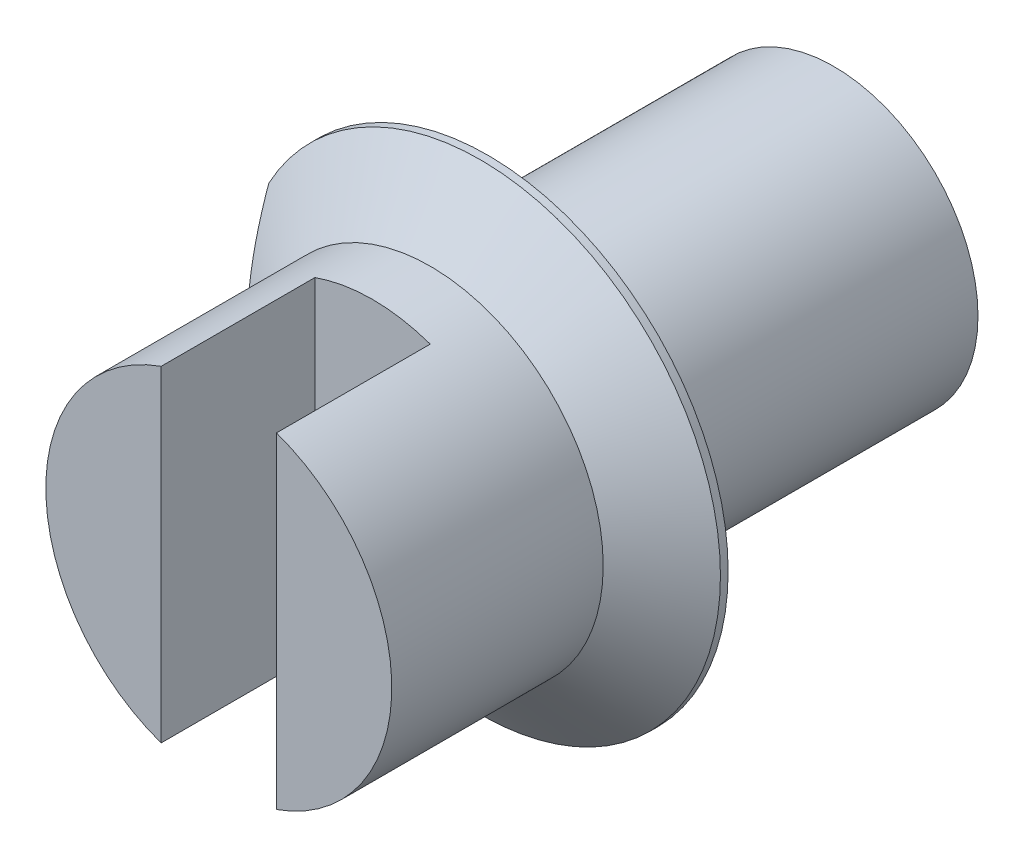
ISO-10303-21;
HEADER;
FILE_DESCRIPTION(('STEP AP214'),'2;1');
FILE_NAME('part.step','',(''),(''),'','','');
FILE_SCHEMA(('AUTOMOTIVE_DESIGN { 1 0 10303 214 1 1 1 1 }'));
ENDSEC;
DATA;
#1=APPLICATION_CONTEXT('core data for automotive mechanical design processes');
#2=APPLICATION_PROTOCOL_DEFINITION('international standard','automotive_design',2000,#1);
#3=PRODUCT_CONTEXT('',#1,'mechanical');
#4=PRODUCT('Part','Part','',(#3));
#5=PRODUCT_RELATED_PRODUCT_CATEGORY('part','',(#4));
#6=PRODUCT_DEFINITION_FORMATION('','',#4);
#7=PRODUCT_DEFINITION_CONTEXT('part definition',#1,'design');
#8=PRODUCT_DEFINITION('design','',#6,#7);
#9=PRODUCT_DEFINITION_SHAPE('','',#8);
#10=(LENGTH_UNIT() NAMED_UNIT(*) SI_UNIT(.MILLI.,.METRE.));
#11=(NAMED_UNIT(*) PLANE_ANGLE_UNIT() SI_UNIT($,.RADIAN.));
#12=(NAMED_UNIT(*) SI_UNIT($,.STERADIAN.) SOLID_ANGLE_UNIT());
#13=UNCERTAINTY_MEASURE_WITH_UNIT(LENGTH_MEASURE(1.E-05),#10,'distance_accuracy_value','');
#14=(GEOMETRIC_REPRESENTATION_CONTEXT(3) GLOBAL_UNCERTAINTY_ASSIGNED_CONTEXT((#13)) GLOBAL_UNIT_ASSIGNED_CONTEXT((#10,
#11,#12)) REPRESENTATION_CONTEXT('',''));
#15=CARTESIAN_POINT('',(0.,0.,0.));
#16=DIRECTION('',(0.,0.,1.));
#17=DIRECTION('',(1.,0.,0.));
#18=AXIS2_PLACEMENT_3D('',#15,#16,#17);
#19=CARTESIAN_POINT('',(0.,0.,0.7));
#20=DIRECTION('',(0.,0.,1.));
#21=DIRECTION('',(1.,0.,0.));
#22=AXIS2_PLACEMENT_3D('',#19,#20,#21);
#23=PLANE('',#22);
#24=DIRECTION('',(0.,-1.,0.));
#25=VECTOR('',#24,1.);
#26=CARTESIAN_POINT('',(-0.15,0.,0.7));
#27=LINE('',#26,#25);
#28=CARTESIAN_POINT('',(-0.15,0.424264068711929,0.7));
#29=VERTEX_POINT('',#28);
#30=CARTESIAN_POINT('',(-0.15,-0.424264068711928,0.7));
#31=VERTEX_POINT('',#30);
#32=EDGE_CURVE('E105',#29,#31,#27,.T.);
#33=ORIENTED_EDGE('',*,*,#32,.F.);
#34=CARTESIAN_POINT('',(0.,0.,0.7));
#35=DIRECTION('',(0.,0.,1.));
#36=DIRECTION('',(1.,0.,0.));
#37=AXIS2_PLACEMENT_3D('',#34,#35,#36);
#38=CIRCLE('',#37,0.45);
#39=EDGE_CURVE('E116',#29,#31,#38,.T.);
#40=ORIENTED_EDGE('',*,*,#39,.T.);
#41=EDGE_LOOP('',(#33,#40));
#42=FACE_BOUND('',#41,.T.);
#43=ADVANCED_FACE('F32',(#42),#23,.T.);
#44=CARTESIAN_POINT('',(0.,0.,-0.9));
#45=DIRECTION('',(0.,0.,1.));
#46=DIRECTION('',(1.,0.,0.));
#47=AXIS2_PLACEMENT_3D('',#44,#45,#46);
#48=CYLINDRICAL_SURFACE('',#47,0.375);
#49=CARTESIAN_POINT('',(0.,0.,-0.9));
#50=DIRECTION('',(0.,0.,1.));
#51=DIRECTION('',(1.,0.,0.));
#52=AXIS2_PLACEMENT_3D('',#49,#50,#51);
#53=CIRCLE('',#52,0.375);
#54=CARTESIAN_POINT('',(0.375,0.,-0.9));
#55=VERTEX_POINT('',#54);
#56=EDGE_CURVE('E109',#55,#55,#53,.T.);
#57=ORIENTED_EDGE('',*,*,#56,.T.);
#58=EDGE_LOOP('',(#57));
#59=FACE_BOUND('',#58,.T.);
#60=CARTESIAN_POINT('',(0.,0.,0.));
#61=DIRECTION('',(0.,0.,1.));
#62=DIRECTION('',(1.,0.,0.));
#63=AXIS2_PLACEMENT_3D('',#60,#61,#62);
#64=CIRCLE('',#63,0.375);
#65=CARTESIAN_POINT('',(0.375,0.,0.));
#66=VERTEX_POINT('',#65);
#67=EDGE_CURVE('E110',#66,#66,#64,.T.);
#68=ORIENTED_EDGE('',*,*,#67,.F.);
#69=EDGE_LOOP('',(#68));
#70=FACE_BOUND('',#69,.T.);
#71=ADVANCED_FACE('F157',(#59,#70),#48,.T.);
#72=CARTESIAN_POINT('',(0.,0.,-0.9));
#73=DIRECTION('',(0.,0.,1.));
#74=DIRECTION('',(1.,0.,0.));
#75=AXIS2_PLACEMENT_3D('',#72,#73,#74);
#76=PLANE('',#75);
#77=ORIENTED_EDGE('',*,*,#56,.F.);
#78=EDGE_LOOP('',(#77));
#79=FACE_BOUND('',#78,.T.);
#80=ADVANCED_FACE('F154',(#79),#76,.F.);
#81=CARTESIAN_POINT('',(0.,0.,0.15));
#82=DIRECTION('',(0.,0.,-1.));
#83=DIRECTION('',(-1.,0.,0.));
#84=AXIS2_PLACEMENT_3D('',#81,#82,#83);
#85=CYLINDRICAL_SURFACE('',#84,0.625);
#86=CARTESIAN_POINT('',(0.,0.,0.0199999999999995));
#87=DIRECTION('',(0.,0.,1.));
#88=DIRECTION('',(1.,0.,0.));
#89=AXIS2_PLACEMENT_3D('',#86,#87,#88);
#90=CIRCLE('',#89,0.625);
#91=CARTESIAN_POINT('',(-0.55,0.29685855217595,0.0200000000000002));
#92=VERTEX_POINT('',#91);
#93=CARTESIAN_POINT('',(-0.55,-0.296858552175948,0.0199999999999995));
#94=VERTEX_POINT('',#93);
#95=EDGE_CURVE('E45',#92,#94,#90,.F.);
#96=ORIENTED_EDGE('',*,*,#95,.T.);
#97=DIRECTION('',(0.,0.,-1.));
#98=VECTOR('',#97,1.);
#99=CARTESIAN_POINT('',(-0.55,-0.296858552175948,0.15));
#100=LINE('',#99,#98);
#101=CARTESIAN_POINT('',(-0.55,-0.296858552175948,0.));
#102=VERTEX_POINT('',#101);
#103=EDGE_CURVE('E51',#94,#102,#100,.T.);
#104=ORIENTED_EDGE('',*,*,#103,.T.);
#105=CARTESIAN_POINT('',(0.,0.,0.));
#106=DIRECTION('',(0.,0.,1.));
#107=DIRECTION('',(1.,0.,0.));
#108=AXIS2_PLACEMENT_3D('',#105,#106,#107);
#109=CIRCLE('',#108,0.625);
#110=CARTESIAN_POINT('',(-0.55,0.296858552175948,0.));
#111=VERTEX_POINT('',#110);
#112=EDGE_CURVE('E98',#102,#111,#109,.T.);
#113=ORIENTED_EDGE('',*,*,#112,.T.);
#114=DIRECTION('',(0.,0.,-1.));
#115=VECTOR('',#114,1.);
#116=CARTESIAN_POINT('',(-0.55,0.296858552175948,0.15));
#117=LINE('',#116,#115);
#118=EDGE_CURVE('E89',#111,#92,#117,.F.);
#119=ORIENTED_EDGE('',*,*,#118,.T.);
#120=EDGE_LOOP('',(#96,#104,#113,#119));
#121=FACE_BOUND('',#120,.T.);
#122=ADVANCED_FACE('F96',(#121),#85,.T.);
#123=CARTESIAN_POINT('',(0.,0.,0.));
#124=DIRECTION('',(0.,0.,1.));
#125=DIRECTION('',(1.,0.,0.));
#126=AXIS2_PLACEMENT_3D('',#123,#124,#125);
#127=PLANE('',#126);
#128=ORIENTED_EDGE('',*,*,#67,.T.);
#129=EDGE_LOOP('',(#128));
#130=FACE_BOUND('',#129,.T.);
#131=ORIENTED_EDGE('',*,*,#112,.F.);
#132=DIRECTION('',(0.,1.,0.));
#133=VECTOR('',#132,1.);
#134=CARTESIAN_POINT('',(-0.55,0.,0.));
#135=LINE('',#134,#133);
#136=EDGE_CURVE('E139',#102,#111,#135,.T.);
#137=ORIENTED_EDGE('',*,*,#136,.T.);
#138=EDGE_LOOP('',(#131,#137));
#139=FACE_BOUND('',#138,.T.);
#140=ADVANCED_FACE('F142',(#130,#139),#127,.F.);
#141=CARTESIAN_POINT('',(0.,0.,0.7));
#142=DIRECTION('',(0.,0.,-1.));
#143=DIRECTION('',(-1.,0.,0.));
#144=AXIS2_PLACEMENT_3D('',#141,#142,#143);
#145=CYLINDRICAL_SURFACE('',#144,0.45);
#146=ORIENTED_EDGE('',*,*,#39,.F.);
#147=DIRECTION('',(0.,0.,-1.));
#148=VECTOR('',#147,1.);
#149=CARTESIAN_POINT('',(-0.15,0.424264068711929,0.7));
#150=LINE('',#149,#148);
#151=CARTESIAN_POINT('',(-0.15,0.424264068711929,0.3));
#152=VERTEX_POINT('',#151);
#153=EDGE_CURVE('E121',#29,#152,#150,.T.);
#154=ORIENTED_EDGE('',*,*,#153,.T.);
#155=CARTESIAN_POINT('',(0.,0.,0.3));
#156=DIRECTION('',(0.,0.,1.));
#157=DIRECTION('',(1.,0.,0.));
#158=AXIS2_PLACEMENT_3D('',#155,#156,#157);
#159=CIRCLE('',#158,0.45);
#160=CARTESIAN_POINT('',(0.15,0.424264068711929,0.3));
#161=VERTEX_POINT('',#160);
#162=EDGE_CURVE('E101',#161,#152,#159,.T.);
#163=ORIENTED_EDGE('',*,*,#162,.F.);
#164=DIRECTION('',(0.,0.,-1.));
#165=VECTOR('',#164,1.);
#166=CARTESIAN_POINT('',(0.15,0.424264068711929,0.7));
#167=LINE('',#166,#165);
#168=CARTESIAN_POINT('',(0.15,0.424264068711929,0.7));
#169=VERTEX_POINT('',#168);
#170=EDGE_CURVE('E130',#161,#169,#167,.F.);
#171=ORIENTED_EDGE('',*,*,#170,.T.);
#172=CARTESIAN_POINT('',(0.15,-0.424264068711929,0.7));
#173=VERTEX_POINT('',#172);
#174=EDGE_CURVE('E120',#173,#169,#38,.T.);
#175=ORIENTED_EDGE('',*,*,#174,.F.);
#176=DIRECTION('',(0.,0.,-1.));
#177=VECTOR('',#176,1.);
#178=CARTESIAN_POINT('',(0.15,-0.424264068711929,0.7));
#179=LINE('',#178,#177);
#180=CARTESIAN_POINT('',(0.15,-0.424264068711929,0.3));
#181=VERTEX_POINT('',#180);
#182=EDGE_CURVE('E59',#173,#181,#179,.T.);
#183=ORIENTED_EDGE('',*,*,#182,.T.);
#184=CARTESIAN_POINT('',(-0.15,-0.424264068711929,0.3));
#185=VERTEX_POINT('',#184);
#186=EDGE_CURVE('E102',#185,#181,#159,.T.);
#187=ORIENTED_EDGE('',*,*,#186,.F.);
#188=DIRECTION('',(0.,0.,-1.));
#189=VECTOR('',#188,1.);
#190=CARTESIAN_POINT('',(-0.15,-0.424264068711929,0.7));
#191=LINE('',#190,#189);
#192=EDGE_CURVE('E126',#185,#31,#191,.F.);
#193=ORIENTED_EDGE('',*,*,#192,.T.);
#194=EDGE_LOOP('',(#146,#154,#163,#171,#175,#183,#187,#193));
#195=FACE_BOUND('',#194,.T.);
#196=CARTESIAN_POINT('',(0.,0.,0.15));
#197=DIRECTION('',(0.,0.,1.));
#198=DIRECTION('',(1.,0.,0.));
#199=AXIS2_PLACEMENT_3D('',#196,#197,#198);
#200=CIRCLE('',#199,0.45);
#201=CARTESIAN_POINT('',(0.45,0.,0.15));
#202=VERTEX_POINT('',#201);
#203=EDGE_CURVE('E117',#202,#202,#200,.T.);
#204=ORIENTED_EDGE('',*,*,#203,.T.);
#205=EDGE_LOOP('',(#204));
#206=FACE_BOUND('',#205,.T.);
#207=ADVANCED_FACE('F144',(#195,#206),#145,.T.);
#208=DIRECTION('',(0.,1.,0.));
#209=VECTOR('',#208,1.);
#210=CARTESIAN_POINT('',(0.15,0.,0.7));
#211=LINE('',#210,#209);
#212=EDGE_CURVE('E107',#173,#169,#211,.T.);
#213=ORIENTED_EDGE('',*,*,#212,.F.);
#214=ORIENTED_EDGE('',*,*,#174,.T.);
#215=EDGE_LOOP('',(#213,#214));
#216=FACE_BOUND('',#215,.T.);
#217=ADVANCED_FACE('F151',(#216),#23,.T.);
#218=CARTESIAN_POINT('',(0.,0.,0.3));
#219=DIRECTION('',(0.,0.,1.));
#220=DIRECTION('',(1.,0.,0.));
#221=AXIS2_PLACEMENT_3D('',#218,#219,#220);
#222=PLANE('',#221);
#223=ORIENTED_EDGE('',*,*,#162,.T.);
#224=DIRECTION('',(0.,-1.,0.));
#225=VECTOR('',#224,1.);
#226=CARTESIAN_POINT('',(-0.15,0.735529674386726,0.3));
#227=LINE('',#226,#225);
#228=EDGE_CURVE('E136',#152,#185,#227,.T.);
#229=ORIENTED_EDGE('',*,*,#228,.T.);
#230=ORIENTED_EDGE('',*,*,#186,.T.);
#231=DIRECTION('',(0.,1.,0.));
#232=VECTOR('',#231,1.);
#233=CARTESIAN_POINT('',(0.15,0.735529674386726,0.3));
#234=LINE('',#233,#232);
#235=EDGE_CURVE('E133',#181,#161,#234,.T.);
#236=ORIENTED_EDGE('',*,*,#235,.T.);
#237=EDGE_LOOP('',(#223,#229,#230,#236));
#238=FACE_BOUND('',#237,.T.);
#239=ADVANCED_FACE('F167',(#238),#222,.T.);
#240=CARTESIAN_POINT('',(-0.15,0.735529674386726,0.3));
#241=DIRECTION('',(-1.,0.,0.));
#242=DIRECTION('',(0.,0.,1.));
#243=AXIS2_PLACEMENT_3D('',#240,#241,#242);
#244=PLANE('',#243);
#245=ORIENTED_EDGE('',*,*,#32,.T.);
#246=ORIENTED_EDGE('',*,*,#192,.F.);
#247=ORIENTED_EDGE('',*,*,#228,.F.);
#248=ORIENTED_EDGE('',*,*,#153,.F.);
#249=EDGE_LOOP('',(#245,#246,#247,#248));
#250=FACE_BOUND('',#249,.T.);
#251=ADVANCED_FACE('F172',(#250),#244,.F.);
#252=CARTESIAN_POINT('',(0.15,0.735529674386726,0.3));
#253=DIRECTION('',(1.,0.,0.));
#254=DIRECTION('',(0.,0.,-1.));
#255=AXIS2_PLACEMENT_3D('',#252,#253,#254);
#256=PLANE('',#255);
#257=ORIENTED_EDGE('',*,*,#212,.T.);
#258=ORIENTED_EDGE('',*,*,#170,.F.);
#259=ORIENTED_EDGE('',*,*,#235,.F.);
#260=ORIENTED_EDGE('',*,*,#182,.F.);
#261=EDGE_LOOP('',(#257,#258,#259,#260));
#262=FACE_BOUND('',#261,.T.);
#263=ADVANCED_FACE('F180',(#262),#256,.F.);
#264=CARTESIAN_POINT('',(0.,0.,0.15));
#265=DIRECTION('',(0.,0.,-1.));
#266=DIRECTION('',(-1.,0.,0.));
#267=AXIS2_PLACEMENT_3D('',#264,#265,#266);
#268=CONICAL_SURFACE('',#267,0.449999999999999,0.931882341791011);
#269=CARTESIAN_POINT('',(-0.55,-0.716462401650844,-0.186682650876285));
#270=CARTESIAN_POINT('',(-0.55,-0.697298151222453,-0.175391942110637));
#271=CARTESIAN_POINT('',(-0.55,-0.678062363904139,-0.164222998441477));
#272=CARTESIAN_POINT('',(-0.55,-0.639414802544983,-0.142184357132387));
#273=CARTESIAN_POINT('',(-0.55,-0.620002991350023,-0.131314724720429));
#274=CARTESIAN_POINT('',(-0.55,-0.561213316747465,-0.0991069076481668));
#275=CARTESIAN_POINT('',(-0.55,-0.52152927234925,-0.0783179392142255));
#276=CARTESIAN_POINT('',(-0.55,-0.439507731416396,-0.0381883094268584));
#277=CARTESIAN_POINT('',(-0.55,-0.397126986245723,-0.0189348736363452));
#278=CARTESIAN_POINT('',(-0.55,-0.310879770593373,0.0157328711800588));
#279=CARTESIAN_POINT('',(-0.55,-0.267017768368927,0.0311577267361928));
#280=CARTESIAN_POINT('',(-0.55,-0.198678271066231,0.0501777290732675));
#281=CARTESIAN_POINT('',(-0.55,-0.174804813329831,0.0559223413321259));
#282=CARTESIAN_POINT('',(-0.55,-0.126651312176183,0.065376373703946));
#283=CARTESIAN_POINT('',(-0.55,-0.102371320382051,0.069086050230425));
#284=CARTESIAN_POINT('',(-0.55,-0.0539377695643646,0.0741338682928381));
#285=CARTESIAN_POINT('',(-0.55,-0.0297880333756222,0.0755076939925308));
#286=CARTESIAN_POINT('',(-0.55,0.0185264650528391,0.0758780552672215));
#287=CARTESIAN_POINT('',(-0.55,0.0426912276189106,0.0748745372685352));
#288=CARTESIAN_POINT('',(-0.55,0.111559073243012,0.0686967186494866));
#289=CARTESIAN_POINT('',(-0.55,0.156022465648226,0.0606742214147669));
#290=CARTESIAN_POINT('',(-0.55,0.221857898011278,0.0440058631061163));
#291=CARTESIAN_POINT('',(-0.55,0.243861903355434,0.0375946072043091));
#292=CARTESIAN_POINT('',(-0.55,0.287460526182705,0.0235034598573942));
#293=CARTESIAN_POINT('',(-0.55,0.309055206034327,0.0158237634438594));
#294=CARTESIAN_POINT('',(-0.55,0.37551071310858,-0.00959138365180682));
#295=CARTESIAN_POINT('',(-0.55,0.419702411212119,-0.0290583498974472));
#296=CARTESIAN_POINT('',(-0.55,0.506785724372684,-0.070737300244597));
#297=CARTESIAN_POINT('',(-0.55,0.549675801329871,-0.0929523856172425));
#298=CARTESIAN_POINT('',(-0.55,0.634685435651403,-0.139221872398749));
#299=CARTESIAN_POINT('',(-0.55,0.676800844471238,-0.163283833147474));
#300=CARTESIAN_POINT('',(-0.55,0.760347706899898,-0.212571683501271));
#301=CARTESIAN_POINT('',(-0.55,0.801779043001956,-0.237797770307402));
#302=CARTESIAN_POINT('',(-0.55,0.916724327850539,-0.309299827582175));
#303=CARTESIAN_POINT('',(-0.55,0.989696086636628,-0.35644461183079));
#304=CARTESIAN_POINT('',(-0.55,1.09810594281704,-0.42797090093945));
#305=CARTESIAN_POINT('',(-0.55,1.13389496209756,-0.451828917692056));
#306=CARTESIAN_POINT('',(-0.55,1.20528059407904,-0.499816007023296));
#307=CARTESIAN_POINT('',(-0.55,1.24087724366104,-0.523945024702181));
#308=CARTESIAN_POINT('',(-0.55,1.27640260893016,-0.548179790272833));
#309=B_SPLINE_CURVE_WITH_KNOTS('',3,(#269,#270,#271,#272,#273,#274,#275,#276,#277,#278,#279,
#280,#281,#282,#283,#284,#285,#286,#287,#288,#289,#290,#291,#292,#293,#294,#295,#296,#297,#298,
#299,#300,#301,#302,#303,#304,#305,#306,#307,#308),.UNSPECIFIED.,.F.,.F.,(4,2,2,2,2,2,2,2,2,2,2,
2,2,2,2,2,2,2,2,4),(0.,0.0667275050604274,0.133469438564304,0.267819678801525,0.407371059404232,
0.546533643715957,0.620126867574904,0.693710816136218,0.766160192544351,0.838611201622146,
0.973474619774237,1.04220800816354,1.11093083813647,1.25562210615298,1.40047817488259,
1.54596249163085,1.69147154430622,1.95206406567144,2.08110093805481,2.21011212527582),.UNSPECIFIED.);
#310=EDGE_CURVE('E11',#94,#92,#309,.T.);
#311=ORIENTED_EDGE('',*,*,#310,.F.);
#312=ORIENTED_EDGE('',*,*,#95,.F.);
#313=EDGE_LOOP('',(#311,#312));
#314=FACE_BOUND('',#313,.T.);
#315=ORIENTED_EDGE('',*,*,#203,.F.);
#316=EDGE_LOOP('',(#315));
#317=FACE_BOUND('',#316,.T.);
#318=ADVANCED_FACE('F34',(#314,#317),#268,.T.);
#319=CARTESIAN_POINT('',(-0.55,0.794186448840328,-0.9));
#320=DIRECTION('',(1.,0.,0.));
#321=DIRECTION('',(0.,0.,-1.));
#322=AXIS2_PLACEMENT_3D('',#319,#320,#321);
#323=PLANE('',#322);
#324=ORIENTED_EDGE('',*,*,#103,.F.);
#325=ORIENTED_EDGE('',*,*,#310,.T.);
#326=ORIENTED_EDGE('',*,*,#118,.F.);
#327=ORIENTED_EDGE('',*,*,#136,.F.);
#328=EDGE_LOOP('',(#324,#325,#326,#327));
#329=FACE_BOUND('',#328,.T.);
#330=ADVANCED_FACE('F88',(#329),#323,.F.);
#331=CLOSED_SHELL('',(#43,#71,#80,#122,#140,#207,#217,#239,#251,#263,#318,#330));
#332=MANIFOLD_SOLID_BREP('B2',#331);
#333=ADVANCED_BREP_SHAPE_REPRESENTATION('',(#18,#332),#14);
#334=SHAPE_DEFINITION_REPRESENTATION(#9,#333);
ENDSEC;
END-ISO-10303-21;
